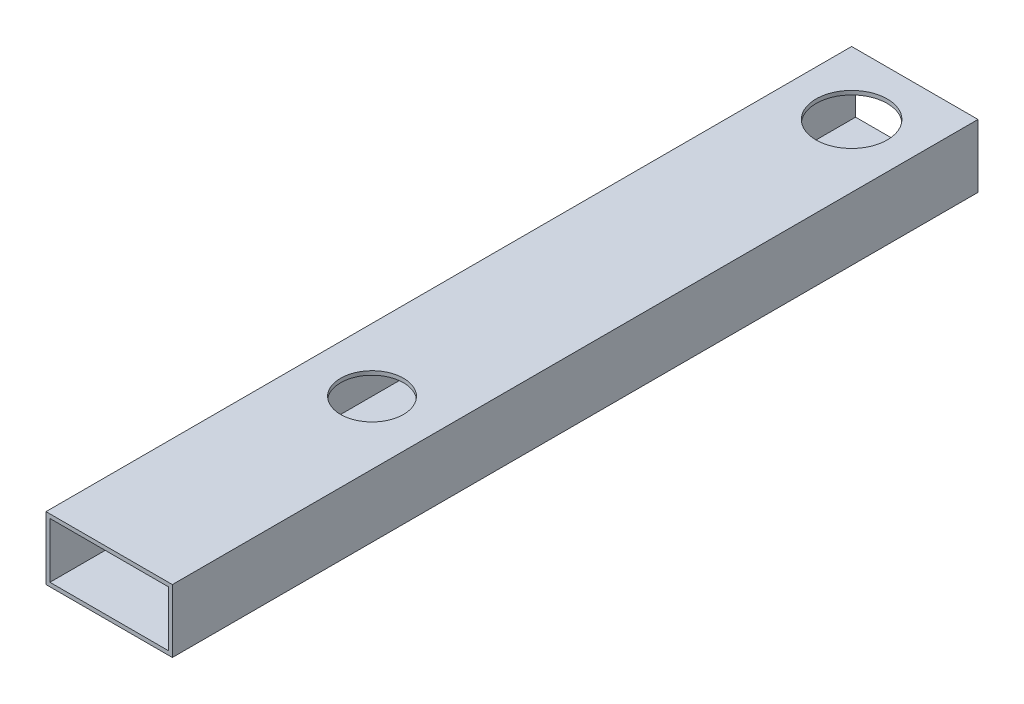
ISO-10303-21;
HEADER;
FILE_DESCRIPTION(('STEP AP214'),'2;1');
FILE_NAME('part.step','',(''),(''),'','','');
FILE_SCHEMA(('AUTOMOTIVE_DESIGN { 1 0 10303 214 1 1 1 1 }'));
ENDSEC;
DATA;
#1=APPLICATION_CONTEXT('core data for automotive mechanical design processes');
#2=APPLICATION_PROTOCOL_DEFINITION('international standard','automotive_design',2000,#1);
#3=PRODUCT_CONTEXT('',#1,'mechanical');
#4=PRODUCT('Part','Part','',(#3));
#5=PRODUCT_RELATED_PRODUCT_CATEGORY('part','',(#4));
#6=PRODUCT_DEFINITION_FORMATION('','',#4);
#7=PRODUCT_DEFINITION_CONTEXT('part definition',#1,'design');
#8=PRODUCT_DEFINITION('design','',#6,#7);
#9=PRODUCT_DEFINITION_SHAPE('','',#8);
#10=(LENGTH_UNIT() NAMED_UNIT(*) SI_UNIT(.MILLI.,.METRE.));
#11=(NAMED_UNIT(*) PLANE_ANGLE_UNIT() SI_UNIT($,.RADIAN.));
#12=(NAMED_UNIT(*) SI_UNIT($,.STERADIAN.) SOLID_ANGLE_UNIT());
#13=UNCERTAINTY_MEASURE_WITH_UNIT(LENGTH_MEASURE(1.E-05),#10,'distance_accuracy_value','');
#14=(GEOMETRIC_REPRESENTATION_CONTEXT(3) GLOBAL_UNCERTAINTY_ASSIGNED_CONTEXT((#13)) GLOBAL_UNIT_ASSIGNED_CONTEXT((#10,
#11,#12)) REPRESENTATION_CONTEXT('',''));
#15=CARTESIAN_POINT('',(0.,0.,0.));
#16=DIRECTION('',(0.,0.,1.));
#17=DIRECTION('',(1.,0.,0.));
#18=AXIS2_PLACEMENT_3D('',#15,#16,#17);
#19=CARTESIAN_POINT('',(0.,0.,323.85));
#20=DIRECTION('',(0.,0.,1.));
#21=DIRECTION('',(1.,0.,0.));
#22=AXIS2_PLACEMENT_3D('',#19,#20,#21);
#23=PLANE('',#22);
#24=DIRECTION('',(0.,-1.,0.));
#25=VECTOR('',#24,1.);
#26=CARTESIAN_POINT('',(-7.20989583333333,5.45703125,323.85));
#27=LINE('',#26,#25);
#28=CARTESIAN_POINT('',(-7.20989583333333,5.45703125,323.85));
#29=VERTEX_POINT('',#28);
#30=CARTESIAN_POINT('',(-7.20989583333332,-19.94296875,323.85));
#31=VERTEX_POINT('',#30);
#32=EDGE_CURVE('E156',#29,#31,#27,.T.);
#33=ORIENTED_EDGE('',*,*,#32,.T.);
#34=DIRECTION('',(1.,0.,0.));
#35=VECTOR('',#34,1.);
#36=CARTESIAN_POINT('',(-7.20989583333332,-19.94296875,323.85));
#37=LINE('',#36,#35);
#38=CARTESIAN_POINT('',(43.5901041666667,-19.94296875,323.85));
#39=VERTEX_POINT('',#38);
#40=EDGE_CURVE('E160',#31,#39,#37,.T.);
#41=ORIENTED_EDGE('',*,*,#40,.T.);
#42=DIRECTION('',(0.,1.,0.));
#43=VECTOR('',#42,1.);
#44=CARTESIAN_POINT('',(43.5901041666667,5.45703125,323.85));
#45=LINE('',#44,#43);
#46=CARTESIAN_POINT('',(43.5901041666667,5.45703125,323.85));
#47=VERTEX_POINT('',#46);
#48=EDGE_CURVE('E164',#39,#47,#45,.T.);
#49=ORIENTED_EDGE('',*,*,#48,.T.);
#50=DIRECTION('',(-1.,0.,0.));
#51=VECTOR('',#50,1.);
#52=CARTESIAN_POINT('',(-7.20989583333333,5.45703125,323.85));
#53=LINE('',#52,#51);
#54=EDGE_CURVE('E167',#47,#29,#53,.T.);
#55=ORIENTED_EDGE('',*,*,#54,.T.);
#56=EDGE_LOOP('',(#33,#41,#49,#55));
#57=FACE_BOUND('',#56,.T.);
#58=DIRECTION('',(1.,0.,0.));
#59=VECTOR('',#58,1.);
#60=CARTESIAN_POINT('',(-5.62239583333332,-18.35546875,323.85));
#61=LINE('',#60,#59);
#62=CARTESIAN_POINT('',(-5.62239583333332,-18.35546875,323.85));
#63=VERTEX_POINT('',#62);
#64=CARTESIAN_POINT('',(42.0026041666667,-18.35546875,323.85));
#65=VERTEX_POINT('',#64);
#66=EDGE_CURVE('E115',#63,#65,#61,.T.);
#67=ORIENTED_EDGE('',*,*,#66,.F.);
#68=DIRECTION('',(0.,-1.,0.));
#69=VECTOR('',#68,1.);
#70=CARTESIAN_POINT('',(-5.62239583333333,3.86953125,323.85));
#71=LINE('',#70,#69);
#72=CARTESIAN_POINT('',(-5.62239583333333,3.86953125,323.85));
#73=VERTEX_POINT('',#72);
#74=EDGE_CURVE('E106',#73,#63,#71,.T.);
#75=ORIENTED_EDGE('',*,*,#74,.F.);
#76=DIRECTION('',(-1.,0.,0.));
#77=VECTOR('',#76,1.);
#78=CARTESIAN_POINT('',(-5.62239583333333,3.86953125,323.85));
#79=LINE('',#78,#77);
#80=CARTESIAN_POINT('',(42.0026041666667,3.86953125,323.85));
#81=VERTEX_POINT('',#80);
#82=EDGE_CURVE('E132',#81,#73,#79,.T.);
#83=ORIENTED_EDGE('',*,*,#82,.F.);
#84=DIRECTION('',(0.,1.,0.));
#85=VECTOR('',#84,1.);
#86=CARTESIAN_POINT('',(42.0026041666667,3.86953125,323.85));
#87=LINE('',#86,#85);
#88=EDGE_CURVE('E128',#65,#81,#87,.T.);
#89=ORIENTED_EDGE('',*,*,#88,.F.);
#90=EDGE_LOOP('',(#67,#75,#83,#89));
#91=FACE_BOUND('',#90,.T.);
#92=ADVANCED_FACE('F38',(#57,#91),#23,.T.);
#93=CARTESIAN_POINT('',(0.,0.,0.));
#94=DIRECTION('',(0.,0.,1.));
#95=DIRECTION('',(1.,0.,0.));
#96=AXIS2_PLACEMENT_3D('',#93,#94,#95);
#97=PLANE('',#96);
#98=DIRECTION('',(0.,-1.,0.));
#99=VECTOR('',#98,1.);
#100=CARTESIAN_POINT('',(-7.20989583333333,5.45703125,0.));
#101=LINE('',#100,#99);
#102=CARTESIAN_POINT('',(-7.20989583333333,5.45703125,0.));
#103=VERTEX_POINT('',#102);
#104=CARTESIAN_POINT('',(-7.20989583333332,-19.94296875,0.));
#105=VERTEX_POINT('',#104);
#106=EDGE_CURVE('E124',#103,#105,#101,.T.);
#107=ORIENTED_EDGE('',*,*,#106,.F.);
#108=DIRECTION('',(-1.,0.,0.));
#109=VECTOR('',#108,1.);
#110=CARTESIAN_POINT('',(-7.20989583333333,5.45703125,0.));
#111=LINE('',#110,#109);
#112=CARTESIAN_POINT('',(43.5901041666667,5.45703125,0.));
#113=VERTEX_POINT('',#112);
#114=EDGE_CURVE('E161',#113,#103,#111,.T.);
#115=ORIENTED_EDGE('',*,*,#114,.F.);
#116=DIRECTION('',(0.,1.,0.));
#117=VECTOR('',#116,1.);
#118=CARTESIAN_POINT('',(43.5901041666667,5.45703125,0.));
#119=LINE('',#118,#117);
#120=CARTESIAN_POINT('',(43.5901041666667,-19.94296875,0.));
#121=VERTEX_POINT('',#120);
#122=EDGE_CURVE('E177',#121,#113,#119,.T.);
#123=ORIENTED_EDGE('',*,*,#122,.F.);
#124=DIRECTION('',(1.,0.,0.));
#125=VECTOR('',#124,1.);
#126=CARTESIAN_POINT('',(-7.20989583333332,-19.94296875,0.));
#127=LINE('',#126,#125);
#128=EDGE_CURVE('E174',#105,#121,#127,.T.);
#129=ORIENTED_EDGE('',*,*,#128,.F.);
#130=EDGE_LOOP('',(#107,#115,#123,#129));
#131=FACE_BOUND('',#130,.T.);
#132=DIRECTION('',(0.,-1.,0.));
#133=VECTOR('',#132,1.);
#134=CARTESIAN_POINT('',(-5.62239583333333,3.86953125,0.));
#135=LINE('',#134,#133);
#136=CARTESIAN_POINT('',(-5.62239583333333,3.86953125,0.));
#137=VERTEX_POINT('',#136);
#138=CARTESIAN_POINT('',(-5.62239583333332,-18.35546875,0.));
#139=VERTEX_POINT('',#138);
#140=EDGE_CURVE('E64',#137,#139,#135,.T.);
#141=ORIENTED_EDGE('',*,*,#140,.T.);
#142=DIRECTION('',(1.,0.,0.));
#143=VECTOR('',#142,1.);
#144=CARTESIAN_POINT('',(-5.62239583333332,-18.35546875,0.));
#145=LINE('',#144,#143);
#146=CARTESIAN_POINT('',(42.0026041666667,-18.35546875,0.));
#147=VERTEX_POINT('',#146);
#148=EDGE_CURVE('E122',#139,#147,#145,.T.);
#149=ORIENTED_EDGE('',*,*,#148,.T.);
#150=DIRECTION('',(0.,1.,0.));
#151=VECTOR('',#150,1.);
#152=CARTESIAN_POINT('',(42.0026041666667,3.86953125,0.));
#153=LINE('',#152,#151);
#154=CARTESIAN_POINT('',(42.0026041666667,3.86953125,0.));
#155=VERTEX_POINT('',#154);
#156=EDGE_CURVE('E143',#147,#155,#153,.T.);
#157=ORIENTED_EDGE('',*,*,#156,.T.);
#158=DIRECTION('',(-1.,0.,0.));
#159=VECTOR('',#158,1.);
#160=CARTESIAN_POINT('',(-5.62239583333333,3.86953125,0.));
#161=LINE('',#160,#159);
#162=EDGE_CURVE('E116',#155,#137,#161,.T.);
#163=ORIENTED_EDGE('',*,*,#162,.T.);
#164=EDGE_LOOP('',(#141,#149,#157,#163));
#165=FACE_BOUND('',#164,.T.);
#166=ADVANCED_FACE('F237',(#131,#165),#97,.F.);
#167=CARTESIAN_POINT('',(-7.20989583333333,5.45703125,323.85));
#168=DIRECTION('',(1.,0.,0.));
#169=DIRECTION('',(0.,1.,0.));
#170=AXIS2_PLACEMENT_3D('',#167,#168,#169);
#171=PLANE('',#170);
#172=ORIENTED_EDGE('',*,*,#106,.T.);
#173=DIRECTION('',(0.,0.,-1.));
#174=VECTOR('',#173,1.);
#175=CARTESIAN_POINT('',(-7.20989583333332,-19.94296875,323.85));
#176=LINE('',#175,#174);
#177=EDGE_CURVE('E11',#31,#105,#176,.T.);
#178=ORIENTED_EDGE('',*,*,#177,.F.);
#179=ORIENTED_EDGE('',*,*,#32,.F.);
#180=DIRECTION('',(0.,0.,-1.));
#181=VECTOR('',#180,1.);
#182=CARTESIAN_POINT('',(-7.20989583333333,5.45703125,323.85));
#183=LINE('',#182,#181);
#184=EDGE_CURVE('E170',#29,#103,#183,.T.);
#185=ORIENTED_EDGE('',*,*,#184,.T.);
#186=EDGE_LOOP('',(#172,#178,#179,#185));
#187=FACE_BOUND('',#186,.T.);
#188=ADVANCED_FACE('F40',(#187),#171,.F.);
#189=CARTESIAN_POINT('',(-7.20989583333332,-19.94296875,323.85));
#190=DIRECTION('',(0.,1.,0.));
#191=DIRECTION('',(0.,0.,1.));
#192=AXIS2_PLACEMENT_3D('',#189,#190,#191);
#193=PLANE('',#192);
#194=CARTESIAN_POINT('',(18.1901041666667,-19.94296875,218.186));
#195=DIRECTION('',(0.,1.,0.));
#196=DIRECTION('',(0.,0.,1.));
#197=AXIS2_PLACEMENT_3D('',#194,#195,#196);
#198=CIRCLE('',#197,12.6378984205352);
#199=CARTESIAN_POINT('',(18.1901041666667,-19.94296875,230.823898420535));
#200=VERTEX_POINT('',#199);
#201=EDGE_CURVE('E217',#200,#200,#198,.T.);
#202=ORIENTED_EDGE('',*,*,#201,.T.);
#203=EDGE_LOOP('',(#202));
#204=FACE_BOUND('',#203,.T.);
#205=CARTESIAN_POINT('',(18.1901041666667,-19.94296875,25.4));
#206=DIRECTION('',(0.,1.,0.));
#207=DIRECTION('',(0.,0.,1.));
#208=AXIS2_PLACEMENT_3D('',#205,#206,#207);
#209=CIRCLE('',#208,14.3056006845561);
#210=CARTESIAN_POINT('',(18.1901041666667,-19.94296875,39.7056006845561));
#211=VERTEX_POINT('',#210);
#212=EDGE_CURVE('E194',#211,#211,#209,.T.);
#213=ORIENTED_EDGE('',*,*,#212,.T.);
#214=EDGE_LOOP('',(#213));
#215=FACE_BOUND('',#214,.T.);
#216=ORIENTED_EDGE('',*,*,#128,.T.);
#217=DIRECTION('',(0.,0.,-1.));
#218=VECTOR('',#217,1.);
#219=CARTESIAN_POINT('',(43.5901041666667,-19.94296875,323.85));
#220=LINE('',#219,#218);
#221=EDGE_CURVE('E48',#39,#121,#220,.T.);
#222=ORIENTED_EDGE('',*,*,#221,.F.);
#223=ORIENTED_EDGE('',*,*,#40,.F.);
#224=ORIENTED_EDGE('',*,*,#177,.T.);
#225=EDGE_LOOP('',(#216,#222,#223,#224));
#226=FACE_BOUND('',#225,.T.);
#227=ADVANCED_FACE('F264',(#204,#215,#226),#193,.F.);
#228=CARTESIAN_POINT('',(43.5901041666667,5.45703125,323.85));
#229=DIRECTION('',(-1.,0.,0.));
#230=DIRECTION('',(0.,0.,1.));
#231=AXIS2_PLACEMENT_3D('',#228,#229,#230);
#232=PLANE('',#231);
#233=ORIENTED_EDGE('',*,*,#122,.T.);
#234=DIRECTION('',(0.,0.,-1.));
#235=VECTOR('',#234,1.);
#236=CARTESIAN_POINT('',(43.5901041666667,5.45703125,323.85));
#237=LINE('',#236,#235);
#238=EDGE_CURVE('E185',#47,#113,#237,.T.);
#239=ORIENTED_EDGE('',*,*,#238,.F.);
#240=ORIENTED_EDGE('',*,*,#48,.F.);
#241=ORIENTED_EDGE('',*,*,#221,.T.);
#242=EDGE_LOOP('',(#233,#239,#240,#241));
#243=FACE_BOUND('',#242,.T.);
#244=ADVANCED_FACE('F261',(#243),#232,.F.);
#245=CARTESIAN_POINT('',(-7.20989583333333,5.45703125,323.85));
#246=DIRECTION('',(0.,-1.,0.));
#247=DIRECTION('',(0.,0.,-1.));
#248=AXIS2_PLACEMENT_3D('',#245,#246,#247);
#249=PLANE('',#248);
#250=CARTESIAN_POINT('',(18.1901041666667,5.45703125,218.186));
#251=DIRECTION('',(0.,1.,0.));
#252=DIRECTION('',(0.,0.,1.));
#253=AXIS2_PLACEMENT_3D('',#250,#251,#252);
#254=CIRCLE('',#253,12.6378984205352);
#255=CARTESIAN_POINT('',(18.1901041666667,5.45703125,230.823898420535));
#256=VERTEX_POINT('',#255);
#257=EDGE_CURVE('E213',#256,#256,#254,.T.);
#258=ORIENTED_EDGE('',*,*,#257,.F.);
#259=EDGE_LOOP('',(#258));
#260=FACE_BOUND('',#259,.T.);
#261=CARTESIAN_POINT('',(18.1901041666667,5.45703125,25.4));
#262=DIRECTION('',(0.,1.,0.));
#263=DIRECTION('',(0.,0.,1.));
#264=AXIS2_PLACEMENT_3D('',#261,#262,#263);
#265=CIRCLE('',#264,14.3056006845561);
#266=CARTESIAN_POINT('',(18.1901041666667,5.45703125,39.7056006845561));
#267=VERTEX_POINT('',#266);
#268=EDGE_CURVE('E201',#267,#267,#265,.T.);
#269=ORIENTED_EDGE('',*,*,#268,.F.);
#270=EDGE_LOOP('',(#269));
#271=FACE_BOUND('',#270,.T.);
#272=ORIENTED_EDGE('',*,*,#114,.T.);
#273=ORIENTED_EDGE('',*,*,#184,.F.);
#274=ORIENTED_EDGE('',*,*,#54,.F.);
#275=ORIENTED_EDGE('',*,*,#238,.T.);
#276=EDGE_LOOP('',(#272,#273,#274,#275));
#277=FACE_BOUND('',#276,.T.);
#278=ADVANCED_FACE('F258',(#260,#271,#277),#249,.F.);
#279=CARTESIAN_POINT('',(-5.62239583333333,3.86953125,323.85));
#280=DIRECTION('',(1.,0.,0.));
#281=DIRECTION('',(0.,1.,0.));
#282=AXIS2_PLACEMENT_3D('',#279,#280,#281);
#283=PLANE('',#282);
#284=ORIENTED_EDGE('',*,*,#140,.F.);
#285=DIRECTION('',(0.,0.,-1.));
#286=VECTOR('',#285,1.);
#287=CARTESIAN_POINT('',(-5.62239583333333,3.86953125,323.85));
#288=LINE('',#287,#286);
#289=EDGE_CURVE('E110',#73,#137,#288,.T.);
#290=ORIENTED_EDGE('',*,*,#289,.F.);
#291=ORIENTED_EDGE('',*,*,#74,.T.);
#292=DIRECTION('',(0.,0.,-1.));
#293=VECTOR('',#292,1.);
#294=CARTESIAN_POINT('',(-5.62239583333332,-18.35546875,323.85));
#295=LINE('',#294,#293);
#296=EDGE_CURVE('E109',#63,#139,#295,.T.);
#297=ORIENTED_EDGE('',*,*,#296,.T.);
#298=EDGE_LOOP('',(#284,#290,#291,#297));
#299=FACE_BOUND('',#298,.T.);
#300=ADVANCED_FACE('F108',(#299),#283,.T.);
#301=CARTESIAN_POINT('',(-5.62239583333332,-18.35546875,323.85));
#302=DIRECTION('',(0.,1.,0.));
#303=DIRECTION('',(0.,0.,1.));
#304=AXIS2_PLACEMENT_3D('',#301,#302,#303);
#305=PLANE('',#304);
#306=CARTESIAN_POINT('',(18.1901041666667,-18.35546875,218.186));
#307=DIRECTION('',(0.,1.,0.));
#308=DIRECTION('',(0.,0.,1.));
#309=AXIS2_PLACEMENT_3D('',#306,#307,#308);
#310=CIRCLE('',#309,12.6378984205352);
#311=CARTESIAN_POINT('',(18.1901041666667,-18.35546875,230.823898420535));
#312=VERTEX_POINT('',#311);
#313=EDGE_CURVE('E207',#312,#312,#310,.T.);
#314=ORIENTED_EDGE('',*,*,#313,.F.);
#315=EDGE_LOOP('',(#314));
#316=FACE_BOUND('',#315,.T.);
#317=CARTESIAN_POINT('',(18.1901041666667,-18.35546875,25.4));
#318=DIRECTION('',(0.,1.,0.));
#319=DIRECTION('',(0.,0.,1.));
#320=AXIS2_PLACEMENT_3D('',#317,#318,#319);
#321=CIRCLE('',#320,14.3056006845561);
#322=CARTESIAN_POINT('',(18.1901041666667,-18.35546875,39.7056006845561));
#323=VERTEX_POINT('',#322);
#324=EDGE_CURVE('E140',#323,#323,#321,.T.);
#325=ORIENTED_EDGE('',*,*,#324,.F.);
#326=EDGE_LOOP('',(#325));
#327=FACE_BOUND('',#326,.T.);
#328=ORIENTED_EDGE('',*,*,#148,.F.);
#329=ORIENTED_EDGE('',*,*,#296,.F.);
#330=ORIENTED_EDGE('',*,*,#66,.T.);
#331=DIRECTION('',(0.,0.,-1.));
#332=VECTOR('',#331,1.);
#333=CARTESIAN_POINT('',(42.0026041666667,-18.35546875,323.85));
#334=LINE('',#333,#332);
#335=EDGE_CURVE('E125',#65,#147,#334,.T.);
#336=ORIENTED_EDGE('',*,*,#335,.T.);
#337=EDGE_LOOP('',(#328,#329,#330,#336));
#338=FACE_BOUND('',#337,.T.);
#339=ADVANCED_FACE('F119',(#316,#327,#338),#305,.T.);
#340=CARTESIAN_POINT('',(42.0026041666667,3.86953125,323.85));
#341=DIRECTION('',(-1.,0.,0.));
#342=DIRECTION('',(0.,-1.,0.));
#343=AXIS2_PLACEMENT_3D('',#340,#341,#342);
#344=PLANE('',#343);
#345=ORIENTED_EDGE('',*,*,#156,.F.);
#346=ORIENTED_EDGE('',*,*,#335,.F.);
#347=ORIENTED_EDGE('',*,*,#88,.T.);
#348=DIRECTION('',(0.,0.,-1.));
#349=VECTOR('',#348,1.);
#350=CARTESIAN_POINT('',(42.0026041666667,3.86953125,323.85));
#351=LINE('',#350,#349);
#352=EDGE_CURVE('E56',#81,#155,#351,.T.);
#353=ORIENTED_EDGE('',*,*,#352,.T.);
#354=EDGE_LOOP('',(#345,#346,#347,#353));
#355=FACE_BOUND('',#354,.T.);
#356=ADVANCED_FACE('F233',(#355),#344,.T.);
#357=CARTESIAN_POINT('',(-5.62239583333333,3.86953125,323.85));
#358=DIRECTION('',(0.,-1.,0.));
#359=DIRECTION('',(0.,0.,-1.));
#360=AXIS2_PLACEMENT_3D('',#357,#358,#359);
#361=PLANE('',#360);
#362=CARTESIAN_POINT('',(18.1901041666667,3.86953125,218.186));
#363=DIRECTION('',(0.,-1.,0.));
#364=DIRECTION('',(0.,0.,-1.));
#365=AXIS2_PLACEMENT_3D('',#362,#363,#364);
#366=CIRCLE('',#365,12.6378984205352);
#367=CARTESIAN_POINT('',(18.1901041666667,3.86953125,205.548101579465));
#368=VERTEX_POINT('',#367);
#369=EDGE_CURVE('E42',#368,#368,#366,.T.);
#370=ORIENTED_EDGE('',*,*,#369,.F.);
#371=EDGE_LOOP('',(#370));
#372=FACE_BOUND('',#371,.T.);
#373=CARTESIAN_POINT('',(18.1901041666667,3.86953125,25.4));
#374=DIRECTION('',(0.,-1.,0.));
#375=DIRECTION('',(0.,0.,-1.));
#376=AXIS2_PLACEMENT_3D('',#373,#374,#375);
#377=CIRCLE('',#376,14.3056006845561);
#378=CARTESIAN_POINT('',(18.1901041666667,3.86953125,11.0943993154439));
#379=VERTEX_POINT('',#378);
#380=EDGE_CURVE('E191',#379,#379,#377,.T.);
#381=ORIENTED_EDGE('',*,*,#380,.F.);
#382=EDGE_LOOP('',(#381));
#383=FACE_BOUND('',#382,.T.);
#384=ORIENTED_EDGE('',*,*,#162,.F.);
#385=ORIENTED_EDGE('',*,*,#352,.F.);
#386=ORIENTED_EDGE('',*,*,#82,.T.);
#387=ORIENTED_EDGE('',*,*,#289,.T.);
#388=EDGE_LOOP('',(#384,#385,#386,#387));
#389=FACE_BOUND('',#388,.T.);
#390=ADVANCED_FACE('F229',(#372,#383,#389),#361,.T.);
#391=CARTESIAN_POINT('',(18.1901041666667,-19.94296875,25.4));
#392=DIRECTION('',(0.,1.,0.));
#393=DIRECTION('',(0.,0.,1.));
#394=AXIS2_PLACEMENT_3D('',#391,#392,#393);
#395=CYLINDRICAL_SURFACE('',#394,14.3056006845561);
#396=ORIENTED_EDGE('',*,*,#380,.T.);
#397=EDGE_LOOP('',(#396));
#398=FACE_BOUND('',#397,.T.);
#399=ORIENTED_EDGE('',*,*,#268,.T.);
#400=EDGE_LOOP('',(#399));
#401=FACE_BOUND('',#400,.T.);
#402=ADVANCED_FACE('F232',(#398,#401),#395,.F.);
#403=ORIENTED_EDGE('',*,*,#324,.T.);
#404=EDGE_LOOP('',(#403));
#405=FACE_BOUND('',#404,.T.);
#406=ORIENTED_EDGE('',*,*,#212,.F.);
#407=EDGE_LOOP('',(#406));
#408=FACE_BOUND('',#407,.T.);
#409=ADVANCED_FACE('F325',(#405,#408),#395,.F.);
#410=CARTESIAN_POINT('',(18.1901041666667,-19.94296875,218.186));
#411=DIRECTION('',(0.,1.,0.));
#412=DIRECTION('',(0.,0.,1.));
#413=AXIS2_PLACEMENT_3D('',#410,#411,#412);
#414=CYLINDRICAL_SURFACE('',#413,12.6378984205352);
#415=ORIENTED_EDGE('',*,*,#369,.T.);
#416=EDGE_LOOP('',(#415));
#417=FACE_BOUND('',#416,.T.);
#418=ORIENTED_EDGE('',*,*,#257,.T.);
#419=EDGE_LOOP('',(#418));
#420=FACE_BOUND('',#419,.T.);
#421=ADVANCED_FACE('F226',(#417,#420),#414,.F.);
#422=ORIENTED_EDGE('',*,*,#313,.T.);
#423=EDGE_LOOP('',(#422));
#424=FACE_BOUND('',#423,.T.);
#425=ORIENTED_EDGE('',*,*,#201,.F.);
#426=EDGE_LOOP('',(#425));
#427=FACE_BOUND('',#426,.T.);
#428=ADVANCED_FACE('F324',(#424,#427),#414,.F.);
#429=CLOSED_SHELL('',(#92,#166,#188,#227,#244,#278,#300,#339,#356,#390,#402,#409,#421,#428));
#430=MANIFOLD_SOLID_BREP('B2',#429);
#431=ADVANCED_BREP_SHAPE_REPRESENTATION('',(#18,#430),#14);
#432=SHAPE_DEFINITION_REPRESENTATION(#9,#431);
ENDSEC;
END-ISO-10303-21;
